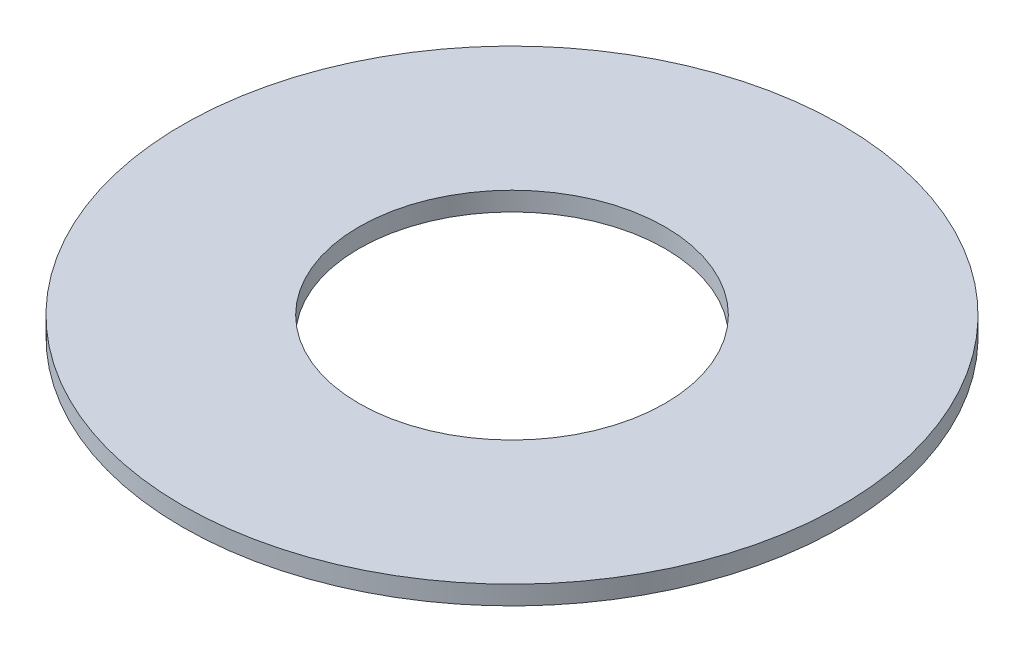
ISO-10303-21;
HEADER;
FILE_DESCRIPTION(('STEP AP214'),'2;1');
FILE_NAME('part.step','',(''),(''),'','','');
FILE_SCHEMA(('AUTOMOTIVE_DESIGN { 1 0 10303 214 1 1 1 1 }'));
ENDSEC;
DATA;
#1=APPLICATION_CONTEXT('core data for automotive mechanical design processes');
#2=APPLICATION_PROTOCOL_DEFINITION('international standard','automotive_design',2000,#1);
#3=PRODUCT_CONTEXT('',#1,'mechanical');
#4=PRODUCT('Part','Part','',(#3));
#5=PRODUCT_RELATED_PRODUCT_CATEGORY('part','',(#4));
#6=PRODUCT_DEFINITION_FORMATION('','',#4);
#7=PRODUCT_DEFINITION_CONTEXT('part definition',#1,'design');
#8=PRODUCT_DEFINITION('design','',#6,#7);
#9=PRODUCT_DEFINITION_SHAPE('','',#8);
#10=(LENGTH_UNIT() NAMED_UNIT(*) SI_UNIT(.MILLI.,.METRE.));
#11=(NAMED_UNIT(*) PLANE_ANGLE_UNIT() SI_UNIT($,.RADIAN.));
#12=(NAMED_UNIT(*) SI_UNIT($,.STERADIAN.) SOLID_ANGLE_UNIT());
#13=UNCERTAINTY_MEASURE_WITH_UNIT(LENGTH_MEASURE(1.E-05),#10,'distance_accuracy_value','');
#14=(GEOMETRIC_REPRESENTATION_CONTEXT(3) GLOBAL_UNCERTAINTY_ASSIGNED_CONTEXT((#13)) GLOBAL_UNIT_ASSIGNED_CONTEXT((#10,
#11,#12)) REPRESENTATION_CONTEXT('',''));
#15=CARTESIAN_POINT('',(0.,0.,0.));
#16=DIRECTION('',(0.,0.,1.));
#17=DIRECTION('',(1.,0.,0.));
#18=AXIS2_PLACEMENT_3D('',#15,#16,#17);
#19=CARTESIAN_POINT('',(0.,4.,0.));
#20=DIRECTION('',(0.,-1.,0.));
#21=DIRECTION('',(0.,0.,-1.));
#22=AXIS2_PLACEMENT_3D('',#19,#20,#21);
#23=CYLINDRICAL_SURFACE('',#22,70.);
#24=CARTESIAN_POINT('',(0.,4.,0.));
#25=DIRECTION('',(0.,1.,0.));
#26=DIRECTION('',(0.,0.,1.));
#27=AXIS2_PLACEMENT_3D('',#24,#25,#26);
#28=CIRCLE('',#27,70.);
#29=CARTESIAN_POINT('',(0.,4.,70.));
#30=VERTEX_POINT('',#29);
#31=EDGE_CURVE('E10',#30,#30,#28,.T.);
#32=ORIENTED_EDGE('',*,*,#31,.F.);
#33=EDGE_LOOP('',(#32));
#34=FACE_BOUND('',#33,.T.);
#35=CARTESIAN_POINT('',(0.,0.,0.));
#36=DIRECTION('',(0.,1.,0.));
#37=DIRECTION('',(0.,0.,1.));
#38=AXIS2_PLACEMENT_3D('',#35,#36,#37);
#39=CIRCLE('',#38,70.);
#40=CARTESIAN_POINT('',(0.,0.,70.));
#41=VERTEX_POINT('',#40);
#42=EDGE_CURVE('E37',#41,#41,#39,.T.);
#43=ORIENTED_EDGE('',*,*,#42,.T.);
#44=EDGE_LOOP('',(#43));
#45=FACE_BOUND('',#44,.T.);
#46=ADVANCED_FACE('F40',(#34,#45),#23,.T.);
#47=CARTESIAN_POINT('',(0.,4.,0.));
#48=DIRECTION('',(0.,1.,0.));
#49=DIRECTION('',(0.,0.,1.));
#50=AXIS2_PLACEMENT_3D('',#47,#48,#49);
#51=PLANE('',#50);
#52=CARTESIAN_POINT('',(0.,4.,0.));
#53=DIRECTION('',(0.,1.,0.));
#54=DIRECTION('',(0.,0.,1.));
#55=AXIS2_PLACEMENT_3D('',#52,#53,#54);
#56=CIRCLE('',#55,32.5);
#57=CARTESIAN_POINT('',(0.,4.,32.5));
#58=VERTEX_POINT('',#57);
#59=EDGE_CURVE('E50',#58,#58,#56,.T.);
#60=ORIENTED_EDGE('',*,*,#59,.F.);
#61=EDGE_LOOP('',(#60));
#62=FACE_BOUND('',#61,.T.);
#63=ORIENTED_EDGE('',*,*,#31,.T.);
#64=EDGE_LOOP('',(#63));
#65=FACE_BOUND('',#64,.T.);
#66=ADVANCED_FACE('F59',(#62,#65),#51,.T.);
#67=CARTESIAN_POINT('',(0.,0.,0.));
#68=DIRECTION('',(0.,1.,0.));
#69=DIRECTION('',(0.,0.,1.));
#70=AXIS2_PLACEMENT_3D('',#67,#68,#69);
#71=PLANE('',#70);
#72=CARTESIAN_POINT('',(0.,0.,0.));
#73=DIRECTION('',(0.,1.,0.));
#74=DIRECTION('',(0.,0.,1.));
#75=AXIS2_PLACEMENT_3D('',#72,#73,#74);
#76=CIRCLE('',#75,32.5);
#77=CARTESIAN_POINT('',(0.,0.,32.5));
#78=VERTEX_POINT('',#77);
#79=EDGE_CURVE('E47',#78,#78,#76,.T.);
#80=ORIENTED_EDGE('',*,*,#79,.T.);
#81=EDGE_LOOP('',(#80));
#82=FACE_BOUND('',#81,.T.);
#83=ORIENTED_EDGE('',*,*,#42,.F.);
#84=EDGE_LOOP('',(#83));
#85=FACE_BOUND('',#84,.T.);
#86=ADVANCED_FACE('F58',(#82,#85),#71,.F.);
#87=CARTESIAN_POINT('',(0.,4.,0.));
#88=DIRECTION('',(0.,-1.,0.));
#89=DIRECTION('',(0.,0.,-1.));
#90=AXIS2_PLACEMENT_3D('',#87,#88,#89);
#91=CYLINDRICAL_SURFACE('',#90,32.5);
#92=ORIENTED_EDGE('',*,*,#59,.T.);
#93=EDGE_LOOP('',(#92));
#94=FACE_BOUND('',#93,.T.);
#95=ORIENTED_EDGE('',*,*,#79,.F.);
#96=EDGE_LOOP('',(#95));
#97=FACE_BOUND('',#96,.T.);
#98=ADVANCED_FACE('F54',(#94,#97),#91,.F.);
#99=CLOSED_SHELL('',(#46,#66,#86,#98));
#100=MANIFOLD_SOLID_BREP('B2',#99);
#101=ADVANCED_BREP_SHAPE_REPRESENTATION('',(#18,#100),#14);
#102=SHAPE_DEFINITION_REPRESENTATION(#9,#101);
ENDSEC;
END-ISO-10303-21;
